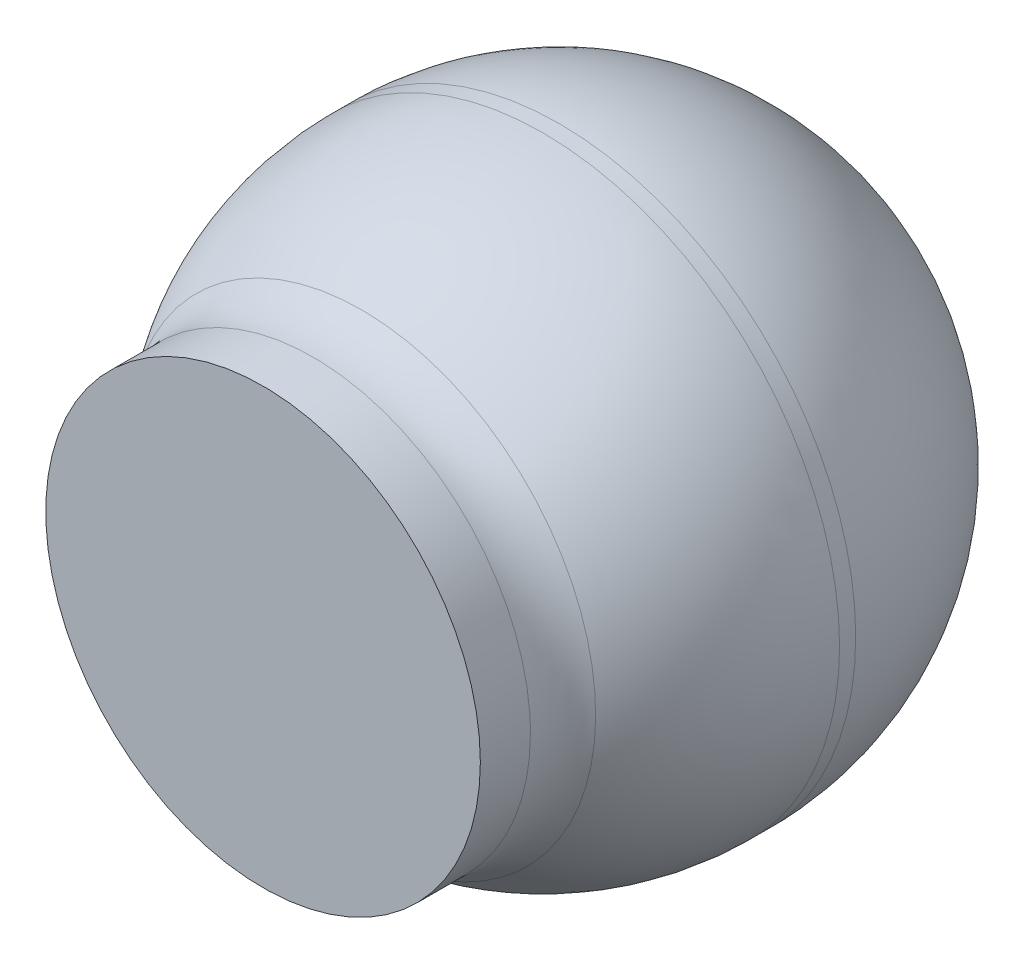
ISO-10303-21;
HEADER;
FILE_DESCRIPTION(('STEP AP214'),'2;1');
FILE_NAME('part.step','',(''),(''),'','','');
FILE_SCHEMA(('AUTOMOTIVE_DESIGN { 1 0 10303 214 1 1 1 1 }'));
ENDSEC;
DATA;
#1=APPLICATION_CONTEXT('core data for automotive mechanical design processes');
#2=APPLICATION_PROTOCOL_DEFINITION('international standard','automotive_design',2000,#1);
#3=PRODUCT_CONTEXT('',#1,'mechanical');
#4=PRODUCT('Part','Part','',(#3));
#5=PRODUCT_RELATED_PRODUCT_CATEGORY('part','',(#4));
#6=PRODUCT_DEFINITION_FORMATION('','',#4);
#7=PRODUCT_DEFINITION_CONTEXT('part definition',#1,'design');
#8=PRODUCT_DEFINITION('design','',#6,#7);
#9=PRODUCT_DEFINITION_SHAPE('','',#8);
#10=(LENGTH_UNIT() NAMED_UNIT(*) SI_UNIT(.MILLI.,.METRE.));
#11=(NAMED_UNIT(*) PLANE_ANGLE_UNIT() SI_UNIT($,.RADIAN.));
#12=(NAMED_UNIT(*) SI_UNIT($,.STERADIAN.) SOLID_ANGLE_UNIT());
#13=UNCERTAINTY_MEASURE_WITH_UNIT(LENGTH_MEASURE(1.E-05),#10,'distance_accuracy_value','');
#14=(GEOMETRIC_REPRESENTATION_CONTEXT(3) GLOBAL_UNCERTAINTY_ASSIGNED_CONTEXT((#13)) GLOBAL_UNIT_ASSIGNED_CONTEXT((#10,
#11,#12)) REPRESENTATION_CONTEXT('',''));
#15=CARTESIAN_POINT('',(0.,0.,0.));
#16=DIRECTION('',(0.,0.,1.));
#17=DIRECTION('',(1.,0.,0.));
#18=AXIS2_PLACEMENT_3D('',#15,#16,#17);
#19=CARTESIAN_POINT('',(-0.562919922269,-2.781349291452,10.006534503384));
#20=DIRECTION('',(0.,0.,-1.));
#21=DIRECTION('',(-1.,0.,0.));
#22=AXIS2_PLACEMENT_3D('',#19,#20,#21);
#23=PLANE('',#22);
#24=CARTESIAN_POINT('',(-0.562919922269,-2.781349291452,10.006534503384));
#25=DIRECTION('',(0.,0.,1.));
#26=DIRECTION('',(1.,0.,0.));
#27=AXIS2_PLACEMENT_3D('',#24,#25,#26);
#28=CIRCLE('',#27,0.275);
#29=CARTESIAN_POINT('',(-0.287919922269,-2.781349291452,10.006534503384));
#30=VERTEX_POINT('',#29);
#31=EDGE_CURVE('E20',#30,#30,#28,.F.);
#32=ORIENTED_EDGE('',*,*,#31,.F.);
#33=EDGE_LOOP('',(#32));
#34=FACE_BOUND('',#33,.T.);
#35=ADVANCED_FACE('F17',(#34),#23,.F.);
#36=CARTESIAN_POINT('',(-0.562919922269,-2.781349291452,9.906534503384));
#37=DIRECTION('',(0.,0.,1.));
#38=DIRECTION('',(1.,0.,0.));
#39=AXIS2_PLACEMENT_3D('',#36,#37,#38);
#40=CYLINDRICAL_SURFACE('',#39,0.275);
#41=CARTESIAN_POINT('',(-0.562919922269,-2.781349291452,9.943180457728));
#42=DIRECTION('',(0.,0.,-1.));
#43=DIRECTION('',(0.996700902337583,0.0811622527992454,0.));
#44=AXIS2_PLACEMENT_3D('',#41,#42,#43);
#45=CIRCLE('',#44,0.275);
#46=CARTESIAN_POINT('',(-0.288827174126165,-2.75902967193221,9.943180457728));
#47=VERTEX_POINT('',#46);
#48=EDGE_CURVE('E65',#47,#47,#45,.F.);
#49=ORIENTED_EDGE('',*,*,#48,.T.);
#50=EDGE_LOOP('',(#49));
#51=FACE_BOUND('',#50,.T.);
#52=ORIENTED_EDGE('',*,*,#31,.T.);
#53=EDGE_LOOP('',(#52));
#54=FACE_BOUND('',#53,.T.);
#55=ADVANCED_FACE('F62',(#51,#54),#40,.T.);
#56=CARTESIAN_POINT('',(-0.562919922269,-2.781349291452,9.943180457728));
#57=DIRECTION('',(0.,0.,-1.));
#58=DIRECTION('',(0.996700902337582,0.081162252799246,0.));
#59=AXIS2_PLACEMENT_3D('',#56,#57,#58);
#60=TOROIDAL_SURFACE('',#59,0.375,0.1);
#61=ORIENTED_EDGE('',*,*,#48,.F.);
#62=EDGE_LOOP('',(#61));
#63=FACE_BOUND('',#62,.T.);
#64=CARTESIAN_POINT('',(-0.562919922268999,-2.781349291452,9.881744931236));
#65=DIRECTION('',(0.,0.,-1.));
#66=DIRECTION('',(-0.996700902337598,-0.0811622527990607,0.));
#67=AXIS2_PLACEMENT_3D('',#64,#65,#66);
#68=CIRCLE('',#67,0.296097046412665);
#69=CARTESIAN_POINT('',(-0.858040115608,-2.805381194786,9.881744931236));
#70=VERTEX_POINT('',#69);
#71=EDGE_CURVE('E39',#70,#70,#68,.T.);
#72=ORIENTED_EDGE('',*,*,#71,.F.);
#73=EDGE_LOOP('',(#72));
#74=FACE_BOUND('',#73,.T.);
#75=ADVANCED_FACE('F57',(#63,#74),#60,.F.);
#76=CARTESIAN_POINT('',(-0.936682760645,-2.811785136252,9.651976062157));
#77=CARTESIAN_POINT('',(-0.936682760645,-2.811785136252,9.701461392103));
#78=CARTESIAN_POINT('',(-0.928526217348,-2.811120941579,9.750947004335));
#79=CARTESIAN_POINT('',(-0.912207085349,-2.809792059952,9.798626332798));
#80=CARTESIAN_POINT('',(-0.888341390838,-2.807848654938,9.842699544317));
#81=CARTESIAN_POINT('',(-0.858040115608,-2.805381194786,9.881744931236));
#82=(BOUNDED_CURVE() B_SPLINE_CURVE(5,(#76,#77,#78,#79,#80,#81),.UNSPECIFIED.,.F.,
.F.) B_SPLINE_CURVE_WITH_KNOTS((6,6),(0.,0.661568582165),
.UNSPECIFIED.) CURVE() GEOMETRIC_REPRESENTATION_ITEM() RATIONAL_B_SPLINE_CURVE((1.,1.,1.,1.,1.,1.)) REPRESENTATION_ITEM(''));
#83=CARTESIAN_POINT('',(-0.562919922269,-2.781349291452,9.651976062157));
#84=DIRECTION('',(0.,0.,-1.));
#85=AXIS1_PLACEMENT('',#83,#84);
#86=SURFACE_OF_REVOLUTION('',#82,#85);
#87=CARTESIAN_POINT('',(-0.562919922268999,-2.781349291452,9.651976062157));
#88=DIRECTION('',(0.,0.,1.));
#89=DIRECTION('',(1.,0.,0.));
#90=AXIS2_PLACEMENT_3D('',#87,#88,#89);
#91=CIRCLE('',#90,0.375);
#92=CARTESIAN_POINT('',(-0.187919922268999,-2.781349291452,9.651976062157));
#93=VERTEX_POINT('',#92);
#94=EDGE_CURVE('E36',#93,#93,#91,.F.);
#95=ORIENTED_EDGE('',*,*,#94,.F.);
#96=EDGE_LOOP('',(#95));
#97=FACE_BOUND('',#96,.T.);
#98=ORIENTED_EDGE('',*,*,#71,.T.);
#99=EDGE_LOOP('',(#98));
#100=FACE_BOUND('',#99,.T.);
#101=ADVANCED_FACE('F53',(#97,#100),#86,.F.);
#102=CARTESIAN_POINT('',(-0.562919922269,-2.781349291452,9.256534503384));
#103=DIRECTION('',(0.,0.,1.));
#104=DIRECTION('',(1.,0.,0.));
#105=AXIS2_PLACEMENT_3D('',#102,#103,#104);
#106=CYLINDRICAL_SURFACE('',#105,0.375);
#107=CARTESIAN_POINT('',(-0.562919922269,-2.781349291452,9.631534503384));
#108=DIRECTION('',(0.,0.,-1.));
#109=DIRECTION('',(0.0811622527992361,-0.996700902337583,0.));
#110=AXIS2_PLACEMENT_3D('',#107,#108,#109);
#111=CIRCLE('',#110,0.375);
#112=CARTESIAN_POINT('',(-0.532484077469286,-3.15511212982859,9.631534503384));
#113=VERTEX_POINT('',#112);
#114=CARTESIAN_POINT('',(-0.593355767068714,-2.40758645307541,9.631534503384));
#115=VERTEX_POINT('',#114);
#116=EDGE_CURVE('E11',#113,#115,#111,.T.);
#117=ORIENTED_EDGE('',*,*,#116,.F.);
#118=CARTESIAN_POINT('',(-0.562919922269,-2.781349291452,9.631534503384));
#119=DIRECTION('',(0.,0.,1.));
#120=DIRECTION('',(0.081162252799236,-0.996700902337583,0.));
#121=AXIS2_PLACEMENT_3D('',#118,#119,#120);
#122=CIRCLE('',#121,0.375);
#123=EDGE_CURVE('E25',#115,#113,#122,.F.);
#124=ORIENTED_EDGE('',*,*,#123,.F.);
#125=EDGE_LOOP('',(#117,#124));
#126=FACE_BOUND('',#125,.T.);
#127=ORIENTED_EDGE('',*,*,#94,.T.);
#128=EDGE_LOOP('',(#127));
#129=FACE_BOUND('',#128,.T.);
#130=ADVANCED_FACE('F34',(#126,#129),#106,.T.);
#131=CARTESIAN_POINT('',(-0.562919922269,-2.781349291452,9.631534503384));
#132=DIRECTION('',(0.0811622527992361,-0.996700902337583,0.));
#133=DIRECTION('',(-0.996700902337583,-0.0811622527992361,0.));
#134=AXIS2_PLACEMENT_3D('',#131,#132,#133);
#135=SPHERICAL_SURFACE('',#134,0.375);
#136=ORIENTED_EDGE('',*,*,#123,.T.);
#137=ORIENTED_EDGE('',*,*,#116,.T.);
#138=EDGE_LOOP('',(#136,#137));
#139=FACE_BOUND('',#138,.T.);
#140=ADVANCED_FACE('F32',(#139),#135,.T.);
#141=CLOSED_SHELL('',(#35,#55,#75,#101,#130,#140));
#142=MANIFOLD_SOLID_BREP('B1',#141);
#143=ADVANCED_BREP_SHAPE_REPRESENTATION('',(#18,#142),#14);
#144=SHAPE_DEFINITION_REPRESENTATION(#9,#143);
ENDSEC;
END-ISO-10303-21;
